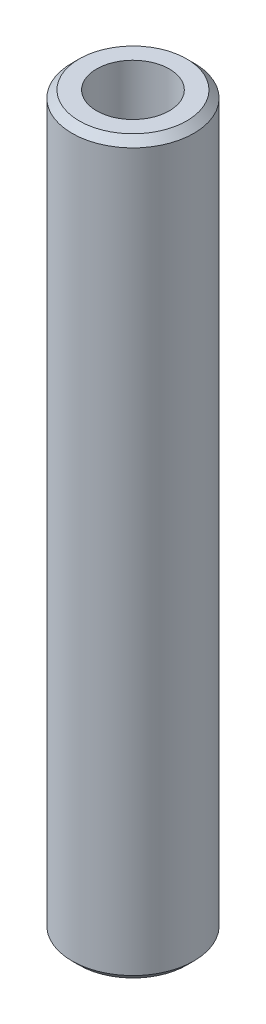
ISO-10303-21;
HEADER;
FILE_DESCRIPTION(('STEP AP214'),'2;1');
FILE_NAME('part.step','',(''),(''),'','','');
FILE_SCHEMA(('AUTOMOTIVE_DESIGN { 1 0 10303 214 1 1 1 1 }'));
ENDSEC;
DATA;
#1=APPLICATION_CONTEXT('core data for automotive mechanical design processes');
#2=APPLICATION_PROTOCOL_DEFINITION('international standard','automotive_design',2000,#1);
#3=PRODUCT_CONTEXT('',#1,'mechanical');
#4=PRODUCT('Part','Part','',(#3));
#5=PRODUCT_RELATED_PRODUCT_CATEGORY('part','',(#4));
#6=PRODUCT_DEFINITION_FORMATION('','',#4);
#7=PRODUCT_DEFINITION_CONTEXT('part definition',#1,'design');
#8=PRODUCT_DEFINITION('design','',#6,#7);
#9=PRODUCT_DEFINITION_SHAPE('','',#8);
#10=(LENGTH_UNIT() NAMED_UNIT(*) SI_UNIT(.MILLI.,.METRE.));
#11=(NAMED_UNIT(*) PLANE_ANGLE_UNIT() SI_UNIT($,.RADIAN.));
#12=(NAMED_UNIT(*) SI_UNIT($,.STERADIAN.) SOLID_ANGLE_UNIT());
#13=UNCERTAINTY_MEASURE_WITH_UNIT(LENGTH_MEASURE(1.E-05),#10,'distance_accuracy_value','');
#14=(GEOMETRIC_REPRESENTATION_CONTEXT(3) GLOBAL_UNCERTAINTY_ASSIGNED_CONTEXT((#13)) GLOBAL_UNIT_ASSIGNED_CONTEXT((#10,
#11,#12)) REPRESENTATION_CONTEXT('',''));
#15=CARTESIAN_POINT('',(0.,0.,0.));
#16=DIRECTION('',(0.,0.,1.));
#17=DIRECTION('',(1.,0.,0.));
#18=AXIS2_PLACEMENT_3D('',#15,#16,#17);
#19=CARTESIAN_POINT('',(0.,600.,0.));
#20=DIRECTION('',(0.,-1.,0.));
#21=DIRECTION('',(0.,0.,-1.));
#22=AXIS2_PLACEMENT_3D('',#19,#20,#21);
#23=CYLINDRICAL_SURFACE('',#22,50.);
#24=CARTESIAN_POINT('',(0.,594.116872910727,0.));
#25=DIRECTION('',(0.,1.,0.));
#26=DIRECTION('',(0.,0.,1.));
#27=AXIS2_PLACEMENT_3D('',#24,#25,#26);
#28=CIRCLE('',#27,50.);
#29=CARTESIAN_POINT('',(0.,594.116872910727,50.));
#30=VERTEX_POINT('',#29);
#31=EDGE_CURVE('E50',#30,#30,#28,.F.);
#32=ORIENTED_EDGE('',*,*,#31,.T.);
#33=EDGE_LOOP('',(#32));
#34=FACE_BOUND('',#33,.T.);
#35=CARTESIAN_POINT('',(0.,5.88312708927263,0.));
#36=DIRECTION('',(0.,1.,0.));
#37=DIRECTION('',(0.,0.,1.));
#38=AXIS2_PLACEMENT_3D('',#35,#36,#37);
#39=CIRCLE('',#38,50.);
#40=CARTESIAN_POINT('',(0.,5.88312708927263,50.));
#41=VERTEX_POINT('',#40);
#42=EDGE_CURVE('E51',#41,#41,#39,.T.);
#43=ORIENTED_EDGE('',*,*,#42,.T.);
#44=EDGE_LOOP('',(#43));
#45=FACE_BOUND('',#44,.T.);
#46=ADVANCED_FACE('F39',(#34,#45),#23,.T.);
#47=CARTESIAN_POINT('',(0.,600.,0.));
#48=DIRECTION('',(0.,1.,0.));
#49=DIRECTION('',(0.,0.,1.));
#50=AXIS2_PLACEMENT_3D('',#47,#48,#49);
#51=PLANE('',#50);
#52=CARTESIAN_POINT('',(0.,600.,0.));
#53=DIRECTION('',(0.,1.,0.));
#54=DIRECTION('',(0.,0.,1.));
#55=AXIS2_PLACEMENT_3D('',#52,#53,#54);
#56=CIRCLE('',#55,44.1168729107274);
#57=CARTESIAN_POINT('',(0.,600.,44.1168729107274));
#58=VERTEX_POINT('',#57);
#59=EDGE_CURVE('E54',#58,#58,#56,.T.);
#60=ORIENTED_EDGE('',*,*,#59,.T.);
#61=EDGE_LOOP('',(#60));
#62=FACE_BOUND('',#61,.T.);
#63=CARTESIAN_POINT('',(0.,600.,0.));
#64=DIRECTION('',(0.,1.,0.));
#65=DIRECTION('',(0.,0.,1.));
#66=AXIS2_PLACEMENT_3D('',#63,#64,#65);
#67=CIRCLE('',#66,29.8253675629787);
#68=CARTESIAN_POINT('',(0.,600.,29.8253675629787));
#69=VERTEX_POINT('',#68);
#70=EDGE_CURVE('E58',#69,#69,#67,.T.);
#71=ORIENTED_EDGE('',*,*,#70,.F.);
#72=EDGE_LOOP('',(#71));
#73=FACE_BOUND('',#72,.T.);
#74=ADVANCED_FACE('F69',(#62,#73),#51,.T.);
#75=CARTESIAN_POINT('',(0.,0.,0.));
#76=DIRECTION('',(0.,1.,0.));
#77=DIRECTION('',(0.,0.,1.));
#78=AXIS2_PLACEMENT_3D('',#75,#76,#77);
#79=PLANE('',#78);
#80=CARTESIAN_POINT('',(0.,0.,0.));
#81=DIRECTION('',(0.,1.,0.));
#82=DIRECTION('',(0.,0.,1.));
#83=AXIS2_PLACEMENT_3D('',#80,#81,#82);
#84=CIRCLE('',#83,44.1168729107273);
#85=CARTESIAN_POINT('',(0.,0.,44.1168729107273));
#86=VERTEX_POINT('',#85);
#87=EDGE_CURVE('E10',#86,#86,#84,.F.);
#88=ORIENTED_EDGE('',*,*,#87,.T.);
#89=EDGE_LOOP('',(#88));
#90=FACE_BOUND('',#89,.T.);
#91=CARTESIAN_POINT('',(0.,0.,0.));
#92=DIRECTION('',(0.,1.,0.));
#93=DIRECTION('',(0.,0.,1.));
#94=AXIS2_PLACEMENT_3D('',#91,#92,#93);
#95=CIRCLE('',#94,29.8253675629787);
#96=CARTESIAN_POINT('',(0.,0.,29.8253675629787));
#97=VERTEX_POINT('',#96);
#98=EDGE_CURVE('E63',#97,#97,#95,.T.);
#99=ORIENTED_EDGE('',*,*,#98,.T.);
#100=EDGE_LOOP('',(#99));
#101=FACE_BOUND('',#100,.T.);
#102=ADVANCED_FACE('F75',(#90,#101),#79,.F.);
#103=CARTESIAN_POINT('',(0.,600.,0.));
#104=DIRECTION('',(0.,-1.,0.));
#105=DIRECTION('',(0.,0.,-1.));
#106=AXIS2_PLACEMENT_3D('',#103,#104,#105);
#107=CYLINDRICAL_SURFACE('',#106,29.8253675629787);
#108=ORIENTED_EDGE('',*,*,#70,.T.);
#109=EDGE_LOOP('',(#108));
#110=FACE_BOUND('',#109,.T.);
#111=ORIENTED_EDGE('',*,*,#98,.F.);
#112=EDGE_LOOP('',(#111));
#113=FACE_BOUND('',#112,.T.);
#114=ADVANCED_FACE('F70',(#110,#113),#107,.F.);
#115=CARTESIAN_POINT('',(0.,600.,0.));
#116=DIRECTION('',(0.,-1.,0.));
#117=DIRECTION('',(0.,0.,-1.));
#118=AXIS2_PLACEMENT_3D('',#115,#116,#117);
#119=CONICAL_SURFACE('',#118,44.1168729107274,0.785398163397449);
#120=ORIENTED_EDGE('',*,*,#31,.F.);
#121=EDGE_LOOP('',(#120));
#122=FACE_BOUND('',#121,.T.);
#123=ORIENTED_EDGE('',*,*,#59,.F.);
#124=EDGE_LOOP('',(#123));
#125=FACE_BOUND('',#124,.T.);
#126=ADVANCED_FACE('F81',(#122,#125),#119,.T.);
#127=CARTESIAN_POINT('',(0.,5.88312708927263,0.));
#128=DIRECTION('',(0.,1.,0.));
#129=DIRECTION('',(0.,0.,1.));
#130=AXIS2_PLACEMENT_3D('',#127,#128,#129);
#131=CONICAL_SURFACE('',#130,50.,0.785398163397458);
#132=ORIENTED_EDGE('',*,*,#87,.F.);
#133=EDGE_LOOP('',(#132));
#134=FACE_BOUND('',#133,.T.);
#135=ORIENTED_EDGE('',*,*,#42,.F.);
#136=EDGE_LOOP('',(#135));
#137=FACE_BOUND('',#136,.T.);
#138=ADVANCED_FACE('F45',(#134,#137),#131,.T.);
#139=CLOSED_SHELL('',(#46,#74,#102,#114,#126,#138));
#140=MANIFOLD_SOLID_BREP('B2',#139);
#141=ADVANCED_BREP_SHAPE_REPRESENTATION('',(#18,#140),#14);
#142=SHAPE_DEFINITION_REPRESENTATION(#9,#141);
ENDSEC;
END-ISO-10303-21;
